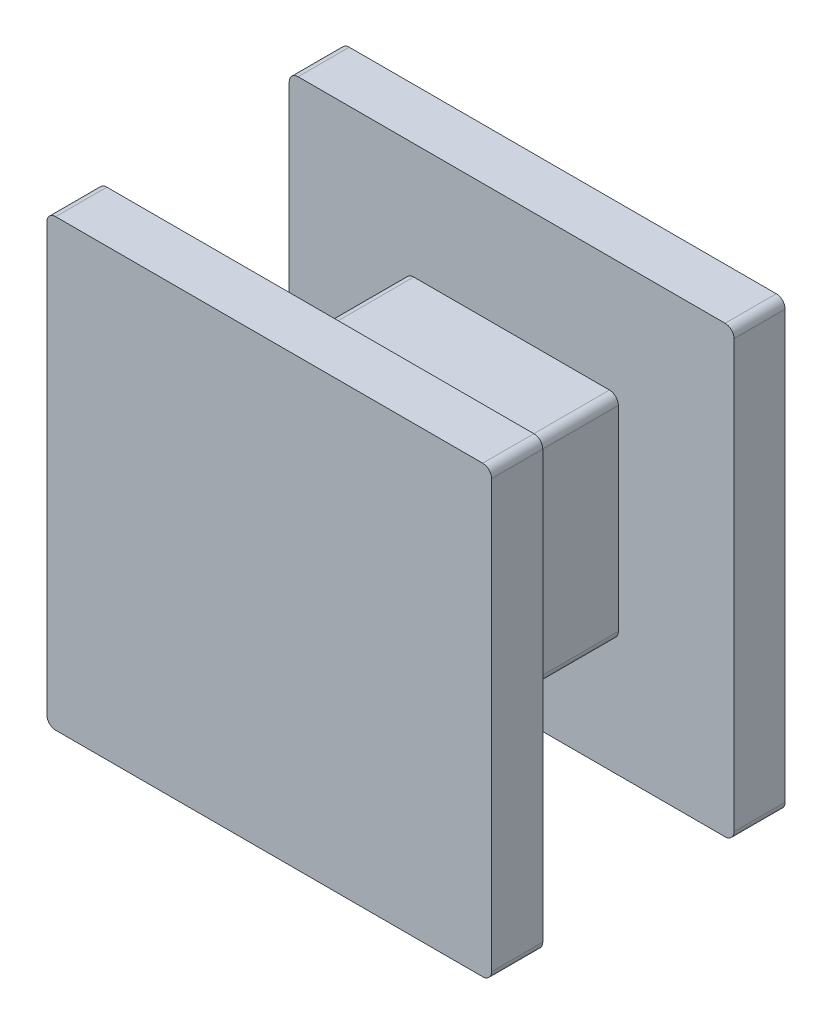
ISO-10303-21;
HEADER;
FILE_DESCRIPTION(('STEP AP214'),'2;1');
FILE_NAME('part.step','',(''),(''),'','','');
FILE_SCHEMA(('AUTOMOTIVE_DESIGN { 1 0 10303 214 1 1 1 1 }'));
ENDSEC;
DATA;
#1=APPLICATION_CONTEXT('core data for automotive mechanical design processes');
#2=APPLICATION_PROTOCOL_DEFINITION('international standard','automotive_design',2000,#1);
#3=PRODUCT_CONTEXT('',#1,'mechanical');
#4=PRODUCT('Part','Part','',(#3));
#5=PRODUCT_RELATED_PRODUCT_CATEGORY('part','',(#4));
#6=PRODUCT_DEFINITION_FORMATION('','',#4);
#7=PRODUCT_DEFINITION_CONTEXT('part definition',#1,'design');
#8=PRODUCT_DEFINITION('design','',#6,#7);
#9=PRODUCT_DEFINITION_SHAPE('','',#8);
#10=(LENGTH_UNIT() NAMED_UNIT(*) SI_UNIT(.MILLI.,.METRE.));
#11=(NAMED_UNIT(*) PLANE_ANGLE_UNIT() SI_UNIT($,.RADIAN.));
#12=(NAMED_UNIT(*) SI_UNIT($,.STERADIAN.) SOLID_ANGLE_UNIT());
#13=UNCERTAINTY_MEASURE_WITH_UNIT(LENGTH_MEASURE(1.E-05),#10,'distance_accuracy_value','');
#14=(GEOMETRIC_REPRESENTATION_CONTEXT(3) GLOBAL_UNCERTAINTY_ASSIGNED_CONTEXT((#13)) GLOBAL_UNIT_ASSIGNED_CONTEXT((#10,
#11,#12)) REPRESENTATION_CONTEXT('',''));
#15=CARTESIAN_POINT('',(0.,0.,0.));
#16=DIRECTION('',(0.,0.,1.));
#17=DIRECTION('',(1.,0.,0.));
#18=AXIS2_PLACEMENT_3D('',#15,#16,#17);
#19=CARTESIAN_POINT('',(0.,0.,4.3));
#20=DIRECTION('',(1.,0.,0.));
#21=DIRECTION('',(0.,1.,0.));
#22=AXIS2_PLACEMENT_3D('',#19,#20,#21);
#23=PLANE('',#22);
#24=DIRECTION('',(0.,-1.,0.));
#25=VECTOR('',#24,1.);
#26=CARTESIAN_POINT('',(0.,0.,0.));
#27=LINE('',#26,#25);
#28=CARTESIAN_POINT('',(0.,-0.2,0.));
#29=VERTEX_POINT('',#28);
#30=CARTESIAN_POINT('',(0.,-4.6,0.));
#31=VERTEX_POINT('',#30);
#32=EDGE_CURVE('E265',#29,#31,#27,.T.);
#33=ORIENTED_EDGE('',*,*,#32,.T.);
#34=DIRECTION('',(0.,0.,-1.));
#35=VECTOR('',#34,1.);
#36=CARTESIAN_POINT('',(0.,-4.6,4.3));
#37=LINE('',#36,#35);
#38=CARTESIAN_POINT('',(0.,-4.6,4.3));
#39=VERTEX_POINT('',#38);
#40=EDGE_CURVE('E375',#31,#39,#37,.F.);
#41=ORIENTED_EDGE('',*,*,#40,.T.);
#42=DIRECTION('',(0.,-1.,0.));
#43=VECTOR('',#42,1.);
#44=CARTESIAN_POINT('',(0.,0.,4.3));
#45=LINE('',#44,#43);
#46=CARTESIAN_POINT('',(0.,-0.2,4.3));
#47=VERTEX_POINT('',#46);
#48=EDGE_CURVE('E248',#47,#39,#45,.T.);
#49=ORIENTED_EDGE('',*,*,#48,.F.);
#50=DIRECTION('',(0.,0.,-1.));
#51=VECTOR('',#50,1.);
#52=CARTESIAN_POINT('',(0.,-0.2,4.3));
#53=LINE('',#52,#51);
#54=EDGE_CURVE('E371',#47,#29,#53,.T.);
#55=ORIENTED_EDGE('',*,*,#54,.T.);
#56=EDGE_LOOP('',(#33,#41,#49,#55));
#57=FACE_BOUND('',#56,.T.);
#58=ADVANCED_FACE('F42',(#57),#23,.F.);
#59=CARTESIAN_POINT('',(0.,-4.8,4.3));
#60=DIRECTION('',(0.,1.,0.));
#61=DIRECTION('',(0.,0.,1.));
#62=AXIS2_PLACEMENT_3D('',#59,#60,#61);
#63=PLANE('',#62);
#64=DIRECTION('',(1.,0.,0.));
#65=VECTOR('',#64,1.);
#66=CARTESIAN_POINT('',(0.,-4.8,0.));
#67=LINE('',#66,#65);
#68=CARTESIAN_POINT('',(0.200000000000001,-4.8,0.));
#69=VERTEX_POINT('',#68);
#70=CARTESIAN_POINT('',(4.6,-4.8,0.));
#71=VERTEX_POINT('',#70);
#72=EDGE_CURVE('E269',#69,#71,#67,.T.);
#73=ORIENTED_EDGE('',*,*,#72,.T.);
#74=DIRECTION('',(0.,0.,-1.));
#75=VECTOR('',#74,1.);
#76=CARTESIAN_POINT('',(4.6,-4.8,4.3));
#77=LINE('',#76,#75);
#78=CARTESIAN_POINT('',(4.6,-4.8,4.3));
#79=VERTEX_POINT('',#78);
#80=EDGE_CURVE('E368',#71,#79,#77,.F.);
#81=ORIENTED_EDGE('',*,*,#80,.T.);
#82=DIRECTION('',(1.,0.,0.));
#83=VECTOR('',#82,1.);
#84=CARTESIAN_POINT('',(0.,-4.8,4.3));
#85=LINE('',#84,#83);
#86=CARTESIAN_POINT('',(0.200000000000001,-4.8,4.3));
#87=VERTEX_POINT('',#86);
#88=EDGE_CURVE('E252',#87,#79,#85,.T.);
#89=ORIENTED_EDGE('',*,*,#88,.F.);
#90=DIRECTION('',(0.,0.,-1.));
#91=VECTOR('',#90,1.);
#92=CARTESIAN_POINT('',(0.200000000000001,-4.8,4.3));
#93=LINE('',#92,#91);
#94=EDGE_CURVE('E364',#87,#69,#93,.T.);
#95=ORIENTED_EDGE('',*,*,#94,.T.);
#96=EDGE_LOOP('',(#73,#81,#89,#95));
#97=FACE_BOUND('',#96,.T.);
#98=ADVANCED_FACE('F449',(#97),#63,.F.);
#99=CARTESIAN_POINT('',(4.8,0.,4.3));
#100=DIRECTION('',(-1.,0.,0.));
#101=DIRECTION('',(0.,-1.,0.));
#102=AXIS2_PLACEMENT_3D('',#99,#100,#101);
#103=PLANE('',#102);
#104=DIRECTION('',(0.,1.,0.));
#105=VECTOR('',#104,1.);
#106=CARTESIAN_POINT('',(4.8,0.,4.3));
#107=LINE('',#106,#105);
#108=CARTESIAN_POINT('',(4.8,-4.6,4.3));
#109=VERTEX_POINT('',#108);
#110=CARTESIAN_POINT('',(4.8,-0.2,4.3));
#111=VERTEX_POINT('',#110);
#112=EDGE_CURVE('E257',#109,#111,#107,.T.);
#113=ORIENTED_EDGE('',*,*,#112,.F.);
#114=DIRECTION('',(0.,0.,-1.));
#115=VECTOR('',#114,1.);
#116=CARTESIAN_POINT('',(4.8,-4.6,4.3));
#117=LINE('',#116,#115);
#118=CARTESIAN_POINT('',(4.8,-4.6,0.));
#119=VERTEX_POINT('',#118);
#120=EDGE_CURVE('E360',#109,#119,#117,.T.);
#121=ORIENTED_EDGE('',*,*,#120,.T.);
#122=DIRECTION('',(0.,1.,0.));
#123=VECTOR('',#122,1.);
#124=CARTESIAN_POINT('',(4.8,0.,0.));
#125=LINE('',#124,#123);
#126=CARTESIAN_POINT('',(4.8,-0.2,0.));
#127=VERTEX_POINT('',#126);
#128=EDGE_CURVE('E274',#119,#127,#125,.T.);
#129=ORIENTED_EDGE('',*,*,#128,.T.);
#130=DIRECTION('',(0.,0.,-1.));
#131=VECTOR('',#130,1.);
#132=CARTESIAN_POINT('',(4.8,-0.2,4.3));
#133=LINE('',#132,#131);
#134=EDGE_CURVE('E357',#127,#111,#133,.F.);
#135=ORIENTED_EDGE('',*,*,#134,.T.);
#136=EDGE_LOOP('',(#113,#121,#129,#135));
#137=FACE_BOUND('',#136,.T.);
#138=ADVANCED_FACE('F427',(#137),#103,.F.);
#139=CARTESIAN_POINT('',(0.,0.,4.3));
#140=DIRECTION('',(0.,-1.,0.));
#141=DIRECTION('',(0.,0.,-1.));
#142=AXIS2_PLACEMENT_3D('',#139,#140,#141);
#143=PLANE('',#142);
#144=DIRECTION('',(-1.,0.,0.));
#145=VECTOR('',#144,1.);
#146=CARTESIAN_POINT('',(0.,0.,0.));
#147=LINE('',#146,#145);
#148=CARTESIAN_POINT('',(4.6,0.,0.));
#149=VERTEX_POINT('',#148);
#150=CARTESIAN_POINT('',(0.2,0.,0.));
#151=VERTEX_POINT('',#150);
#152=EDGE_CURVE('E253',#149,#151,#147,.T.);
#153=ORIENTED_EDGE('',*,*,#152,.T.);
#154=DIRECTION('',(0.,0.,-1.));
#155=VECTOR('',#154,1.);
#156=CARTESIAN_POINT('',(0.2,0.,4.3));
#157=LINE('',#156,#155);
#158=CARTESIAN_POINT('',(0.2,0.,4.3));
#159=VERTEX_POINT('',#158);
#160=EDGE_CURVE('E389',#151,#159,#157,.F.);
#161=ORIENTED_EDGE('',*,*,#160,.T.);
#162=DIRECTION('',(-1.,0.,0.));
#163=VECTOR('',#162,1.);
#164=CARTESIAN_POINT('',(0.,0.,4.3));
#165=LINE('',#164,#163);
#166=CARTESIAN_POINT('',(4.6,0.,4.3));
#167=VERTEX_POINT('',#166);
#168=EDGE_CURVE('E261',#167,#159,#165,.T.);
#169=ORIENTED_EDGE('',*,*,#168,.F.);
#170=DIRECTION('',(0.,0.,-1.));
#171=VECTOR('',#170,1.);
#172=CARTESIAN_POINT('',(4.6,0.,4.3));
#173=LINE('',#172,#171);
#174=EDGE_CURVE('E385',#167,#149,#173,.T.);
#175=ORIENTED_EDGE('',*,*,#174,.T.);
#176=EDGE_LOOP('',(#153,#161,#169,#175));
#177=FACE_BOUND('',#176,.T.);
#178=ADVANCED_FACE('F434',(#177),#143,.F.);
#179=CARTESIAN_POINT('',(0.,0.,4.3));
#180=DIRECTION('',(0.,0.,1.));
#181=DIRECTION('',(1.,0.,0.));
#182=AXIS2_PLACEMENT_3D('',#179,#180,#181);
#183=PLANE('',#182);
#184=DIRECTION('',(0.,1.,0.));
#185=VECTOR('',#184,1.);
#186=CARTESIAN_POINT('',(7.4,2.6,4.3));
#187=LINE('',#186,#185);
#188=CARTESIAN_POINT('',(7.4,-7.2,4.3));
#189=VERTEX_POINT('',#188);
#190=CARTESIAN_POINT('',(7.4,2.4,4.3));
#191=VERTEX_POINT('',#190);
#192=EDGE_CURVE('E223',#189,#191,#187,.T.);
#193=ORIENTED_EDGE('',*,*,#192,.F.);
#194=CARTESIAN_POINT('',(7.2,-7.2,4.3));
#195=DIRECTION('',(0.,0.,1.));
#196=DIRECTION('',(1.,0.,0.));
#197=AXIS2_PLACEMENT_3D('',#194,#195,#196);
#198=CIRCLE('',#197,0.2);
#199=CARTESIAN_POINT('',(7.2,-7.4,4.3));
#200=VERTEX_POINT('',#199);
#201=EDGE_CURVE('E205',#189,#200,#198,.F.);
#202=ORIENTED_EDGE('',*,*,#201,.T.);
#203=DIRECTION('',(1.,0.,0.));
#204=VECTOR('',#203,1.);
#205=CARTESIAN_POINT('',(-2.6,-7.4,4.3));
#206=LINE('',#205,#204);
#207=CARTESIAN_POINT('',(-2.4,-7.4,4.3));
#208=VERTEX_POINT('',#207);
#209=EDGE_CURVE('E237',#208,#200,#206,.T.);
#210=ORIENTED_EDGE('',*,*,#209,.F.);
#211=CARTESIAN_POINT('',(-2.4,-7.2,4.3));
#212=DIRECTION('',(0.,0.,1.));
#213=DIRECTION('',(1.,0.,0.));
#214=AXIS2_PLACEMENT_3D('',#211,#212,#213);
#215=CIRCLE('',#214,0.2);
#216=CARTESIAN_POINT('',(-2.6,-7.2,4.3));
#217=VERTEX_POINT('',#216);
#218=EDGE_CURVE('E217',#208,#217,#215,.F.);
#219=ORIENTED_EDGE('',*,*,#218,.T.);
#220=DIRECTION('',(0.,-1.,0.));
#221=VECTOR('',#220,1.);
#222=CARTESIAN_POINT('',(-2.6,2.6,4.3));
#223=LINE('',#222,#221);
#224=CARTESIAN_POINT('',(-2.6,2.4,4.3));
#225=VERTEX_POINT('',#224);
#226=EDGE_CURVE('E244',#225,#217,#223,.T.);
#227=ORIENTED_EDGE('',*,*,#226,.F.);
#228=CARTESIAN_POINT('',(-2.4,2.4,4.3));
#229=DIRECTION('',(0.,0.,1.));
#230=DIRECTION('',(1.,0.,0.));
#231=AXIS2_PLACEMENT_3D('',#228,#229,#230);
#232=CIRCLE('',#231,0.2);
#233=CARTESIAN_POINT('',(-2.4,2.6,4.3));
#234=VERTEX_POINT('',#233);
#235=EDGE_CURVE('E228',#225,#234,#232,.F.);
#236=ORIENTED_EDGE('',*,*,#235,.T.);
#237=DIRECTION('',(-1.,0.,0.));
#238=VECTOR('',#237,1.);
#239=CARTESIAN_POINT('',(-2.6,2.6,4.3));
#240=LINE('',#239,#238);
#241=CARTESIAN_POINT('',(7.2,2.6,4.3));
#242=VERTEX_POINT('',#241);
#243=EDGE_CURVE('E236',#242,#234,#240,.T.);
#244=ORIENTED_EDGE('',*,*,#243,.F.);
#245=CARTESIAN_POINT('',(7.2,2.4,4.3));
#246=DIRECTION('',(0.,0.,1.));
#247=DIRECTION('',(1.,0.,0.));
#248=AXIS2_PLACEMENT_3D('',#245,#246,#247);
#249=CIRCLE('',#248,0.2);
#250=EDGE_CURVE('E234',#242,#191,#249,.F.);
#251=ORIENTED_EDGE('',*,*,#250,.T.);
#252=EDGE_LOOP('',(#193,#202,#210,#219,#227,#236,#244,#251));
#253=FACE_BOUND('',#252,.T.);
#254=ORIENTED_EDGE('',*,*,#112,.T.);
#255=CARTESIAN_POINT('',(4.6,-0.2,4.3));
#256=DIRECTION('',(0.,0.,1.));
#257=DIRECTION('',(1.,0.,0.));
#258=AXIS2_PLACEMENT_3D('',#255,#256,#257);
#259=CIRCLE('',#258,0.2);
#260=EDGE_CURVE('E11',#111,#167,#259,.T.);
#261=ORIENTED_EDGE('',*,*,#260,.T.);
#262=ORIENTED_EDGE('',*,*,#168,.T.);
#263=CARTESIAN_POINT('',(0.2,-0.2,4.3));
#264=DIRECTION('',(0.,0.,1.));
#265=DIRECTION('',(1.,0.,0.));
#266=AXIS2_PLACEMENT_3D('',#263,#264,#265);
#267=CIRCLE('',#266,0.2);
#268=EDGE_CURVE('E413',#159,#47,#267,.T.);
#269=ORIENTED_EDGE('',*,*,#268,.T.);
#270=ORIENTED_EDGE('',*,*,#48,.T.);
#271=CARTESIAN_POINT('',(0.200000000000001,-4.6,4.3));
#272=DIRECTION('',(0.,0.,1.));
#273=DIRECTION('',(1.,0.,0.));
#274=AXIS2_PLACEMENT_3D('',#271,#272,#273);
#275=CIRCLE('',#274,0.2);
#276=EDGE_CURVE('E407',#39,#87,#275,.T.);
#277=ORIENTED_EDGE('',*,*,#276,.T.);
#278=ORIENTED_EDGE('',*,*,#88,.T.);
#279=CARTESIAN_POINT('',(4.6,-4.6,4.3));
#280=DIRECTION('',(0.,0.,1.));
#281=DIRECTION('',(1.,0.,0.));
#282=AXIS2_PLACEMENT_3D('',#279,#280,#281);
#283=CIRCLE('',#282,0.2);
#284=EDGE_CURVE('E401',#79,#109,#283,.T.);
#285=ORIENTED_EDGE('',*,*,#284,.T.);
#286=EDGE_LOOP('',(#254,#261,#262,#269,#270,#277,#278,#285));
#287=FACE_BOUND('',#286,.T.);
#288=ADVANCED_FACE('F231',(#253,#287),#183,.F.);
#289=CARTESIAN_POINT('',(-2.6,2.6,5.45));
#290=DIRECTION('',(1.,0.,0.));
#291=DIRECTION('',(0.,1.,0.));
#292=AXIS2_PLACEMENT_3D('',#289,#290,#291);
#293=PLANE('',#292);
#294=ORIENTED_EDGE('',*,*,#226,.T.);
#295=DIRECTION('',(0.,0.,-1.));
#296=VECTOR('',#295,1.);
#297=CARTESIAN_POINT('',(-2.6,-7.2,5.45));
#298=LINE('',#297,#296);
#299=CARTESIAN_POINT('',(-2.6,-7.2,5.45));
#300=VERTEX_POINT('',#299);
#301=EDGE_CURVE('E310',#217,#300,#298,.F.);
#302=ORIENTED_EDGE('',*,*,#301,.T.);
#303=DIRECTION('',(0.,-1.,0.));
#304=VECTOR('',#303,1.);
#305=CARTESIAN_POINT('',(-2.6,2.6,5.45));
#306=LINE('',#305,#304);
#307=CARTESIAN_POINT('',(-2.6,2.4,5.45));
#308=VERTEX_POINT('',#307);
#309=EDGE_CURVE('E242',#308,#300,#306,.T.);
#310=ORIENTED_EDGE('',*,*,#309,.F.);
#311=DIRECTION('',(0.,0.,-1.));
#312=VECTOR('',#311,1.);
#313=CARTESIAN_POINT('',(-2.6,2.4,5.45));
#314=LINE('',#313,#312);
#315=EDGE_CURVE('E306',#308,#225,#314,.T.);
#316=ORIENTED_EDGE('',*,*,#315,.T.);
#317=EDGE_LOOP('',(#294,#302,#310,#316));
#318=FACE_BOUND('',#317,.T.);
#319=ADVANCED_FACE('F538',(#318),#293,.F.);
#320=CARTESIAN_POINT('',(-2.6,-7.4,5.45));
#321=DIRECTION('',(0.,1.,0.));
#322=DIRECTION('',(-1.,0.,0.));
#323=AXIS2_PLACEMENT_3D('',#320,#321,#322);
#324=PLANE('',#323);
#325=ORIENTED_EDGE('',*,*,#209,.T.);
#326=DIRECTION('',(0.,0.,-1.));
#327=VECTOR('',#326,1.);
#328=CARTESIAN_POINT('',(7.2,-7.4,5.45));
#329=LINE('',#328,#327);
#330=CARTESIAN_POINT('',(7.2,-7.4,5.45));
#331=VERTEX_POINT('',#330);
#332=EDGE_CURVE('E210',#200,#331,#329,.F.);
#333=ORIENTED_EDGE('',*,*,#332,.T.);
#334=DIRECTION('',(1.,0.,0.));
#335=VECTOR('',#334,1.);
#336=CARTESIAN_POINT('',(-2.6,-7.4,5.45));
#337=LINE('',#336,#335);
#338=CARTESIAN_POINT('',(-2.4,-7.4,5.45));
#339=VERTEX_POINT('',#338);
#340=EDGE_CURVE('E525',#339,#331,#337,.T.);
#341=ORIENTED_EDGE('',*,*,#340,.F.);
#342=DIRECTION('',(0.,0.,-1.));
#343=VECTOR('',#342,1.);
#344=CARTESIAN_POINT('',(-2.4,-7.4,5.45));
#345=LINE('',#344,#343);
#346=EDGE_CURVE('E216',#339,#208,#345,.T.);
#347=ORIENTED_EDGE('',*,*,#346,.T.);
#348=EDGE_LOOP('',(#325,#333,#341,#347));
#349=FACE_BOUND('',#348,.T.);
#350=ADVANCED_FACE('F547',(#349),#324,.F.);
#351=CARTESIAN_POINT('',(7.4,2.6,5.45));
#352=DIRECTION('',(-1.,0.,0.));
#353=DIRECTION('',(0.,-1.,0.));
#354=AXIS2_PLACEMENT_3D('',#351,#352,#353);
#355=PLANE('',#354);
#356=DIRECTION('',(0.,1.,0.));
#357=VECTOR('',#356,1.);
#358=CARTESIAN_POINT('',(7.4,2.6,5.45));
#359=LINE('',#358,#357);
#360=CARTESIAN_POINT('',(7.4,-7.2,5.45));
#361=VERTEX_POINT('',#360);
#362=CARTESIAN_POINT('',(7.4,2.4,5.45));
#363=VERTEX_POINT('',#362);
#364=EDGE_CURVE('E226',#361,#363,#359,.T.);
#365=ORIENTED_EDGE('',*,*,#364,.F.);
#366=DIRECTION('',(0.,0.,-1.));
#367=VECTOR('',#366,1.);
#368=CARTESIAN_POINT('',(7.4,-7.2,5.45));
#369=LINE('',#368,#367);
#370=EDGE_CURVE('E209',#361,#189,#369,.T.);
#371=ORIENTED_EDGE('',*,*,#370,.T.);
#372=ORIENTED_EDGE('',*,*,#192,.T.);
#373=DIRECTION('',(0.,0.,-1.));
#374=VECTOR('',#373,1.);
#375=CARTESIAN_POINT('',(7.4,2.4,5.45));
#376=LINE('',#375,#374);
#377=EDGE_CURVE('E229',#191,#363,#376,.F.);
#378=ORIENTED_EDGE('',*,*,#377,.T.);
#379=EDGE_LOOP('',(#365,#371,#372,#378));
#380=FACE_BOUND('',#379,.T.);
#381=ADVANCED_FACE('F222',(#380),#355,.F.);
#382=CARTESIAN_POINT('',(-2.6,2.6,5.45));
#383=DIRECTION('',(0.,-1.,0.));
#384=DIRECTION('',(1.,0.,0.));
#385=AXIS2_PLACEMENT_3D('',#382,#383,#384);
#386=PLANE('',#385);
#387=DIRECTION('',(-1.,0.,0.));
#388=VECTOR('',#387,1.);
#389=CARTESIAN_POINT('',(-2.6,2.6,5.45));
#390=LINE('',#389,#388);
#391=CARTESIAN_POINT('',(7.2,2.6,5.45));
#392=VERTEX_POINT('',#391);
#393=CARTESIAN_POINT('',(-2.4,2.6,5.45));
#394=VERTEX_POINT('',#393);
#395=EDGE_CURVE('E270',#392,#394,#390,.T.);
#396=ORIENTED_EDGE('',*,*,#395,.F.);
#397=DIRECTION('',(0.,0.,-1.));
#398=VECTOR('',#397,1.);
#399=CARTESIAN_POINT('',(7.2,2.6,5.45));
#400=LINE('',#399,#398);
#401=EDGE_CURVE('E381',#392,#242,#400,.T.);
#402=ORIENTED_EDGE('',*,*,#401,.T.);
#403=ORIENTED_EDGE('',*,*,#243,.T.);
#404=DIRECTION('',(0.,0.,-1.));
#405=VECTOR('',#404,1.);
#406=CARTESIAN_POINT('',(-2.4,2.6,5.45));
#407=LINE('',#406,#405);
#408=EDGE_CURVE('E378',#234,#394,#407,.F.);
#409=ORIENTED_EDGE('',*,*,#408,.T.);
#410=EDGE_LOOP('',(#396,#402,#403,#409));
#411=FACE_BOUND('',#410,.T.);
#412=ADVANCED_FACE('F554',(#411),#386,.F.);
#413=CARTESIAN_POINT('',(0.,0.,5.45));
#414=DIRECTION('',(0.,0.,1.));
#415=DIRECTION('',(1.,0.,0.));
#416=AXIS2_PLACEMENT_3D('',#413,#414,#415);
#417=PLANE('',#416);
#418=ORIENTED_EDGE('',*,*,#340,.T.);
#419=CARTESIAN_POINT('',(7.2,-7.2,5.45));
#420=DIRECTION('',(0.,0.,1.));
#421=DIRECTION('',(1.,0.,0.));
#422=AXIS2_PLACEMENT_3D('',#419,#420,#421);
#423=CIRCLE('',#422,0.2);
#424=EDGE_CURVE('E303',#331,#361,#423,.T.);
#425=ORIENTED_EDGE('',*,*,#424,.T.);
#426=ORIENTED_EDGE('',*,*,#364,.T.);
#427=CARTESIAN_POINT('',(7.2,2.4,5.45));
#428=DIRECTION('',(0.,0.,1.));
#429=DIRECTION('',(1.,0.,0.));
#430=AXIS2_PLACEMENT_3D('',#427,#428,#429);
#431=CIRCLE('',#430,0.2);
#432=EDGE_CURVE('E297',#363,#392,#431,.T.);
#433=ORIENTED_EDGE('',*,*,#432,.T.);
#434=ORIENTED_EDGE('',*,*,#395,.T.);
#435=CARTESIAN_POINT('',(-2.4,2.4,5.45));
#436=DIRECTION('',(0.,0.,1.));
#437=DIRECTION('',(1.,0.,0.));
#438=AXIS2_PLACEMENT_3D('',#435,#436,#437);
#439=CIRCLE('',#438,0.2);
#440=EDGE_CURVE('E294',#394,#308,#439,.T.);
#441=ORIENTED_EDGE('',*,*,#440,.T.);
#442=ORIENTED_EDGE('',*,*,#309,.T.);
#443=CARTESIAN_POINT('',(-2.4,-7.2,5.45));
#444=DIRECTION('',(0.,0.,1.));
#445=DIRECTION('',(1.,0.,0.));
#446=AXIS2_PLACEMENT_3D('',#443,#444,#445);
#447=CIRCLE('',#446,0.2);
#448=EDGE_CURVE('E300',#300,#339,#447,.T.);
#449=ORIENTED_EDGE('',*,*,#448,.T.);
#450=EDGE_LOOP('',(#418,#425,#426,#433,#434,#441,#442,#449));
#451=FACE_BOUND('',#450,.T.);
#452=ADVANCED_FACE('F545',(#451),#417,.T.);
#453=CARTESIAN_POINT('',(7.4,2.6,-1.15));
#454=DIRECTION('',(-1.,0.,0.));
#455=DIRECTION('',(0.,0.,1.));
#456=AXIS2_PLACEMENT_3D('',#453,#454,#455);
#457=PLANE('',#456);
#458=DIRECTION('',(0.,-1.,0.));
#459=VECTOR('',#458,1.);
#460=CARTESIAN_POINT('',(7.4,2.6,0.));
#461=LINE('',#460,#459);
#462=CARTESIAN_POINT('',(7.4,2.4,0.));
#463=VERTEX_POINT('',#462);
#464=CARTESIAN_POINT('',(7.4,-7.2,0.));
#465=VERTEX_POINT('',#464);
#466=EDGE_CURVE('E508',#463,#465,#461,.T.);
#467=ORIENTED_EDGE('',*,*,#466,.T.);
#468=DIRECTION('',(0.,0.,1.));
#469=VECTOR('',#468,1.);
#470=CARTESIAN_POINT('',(7.4,-7.2,-1.15));
#471=LINE('',#470,#469);
#472=CARTESIAN_POINT('',(7.4,-7.2,-1.15));
#473=VERTEX_POINT('',#472);
#474=EDGE_CURVE('E354',#465,#473,#471,.F.);
#475=ORIENTED_EDGE('',*,*,#474,.T.);
#476=DIRECTION('',(0.,-1.,0.));
#477=VECTOR('',#476,1.);
#478=CARTESIAN_POINT('',(7.4,2.6,-1.15));
#479=LINE('',#478,#477);
#480=CARTESIAN_POINT('',(7.4,2.4,-1.15));
#481=VERTEX_POINT('',#480);
#482=EDGE_CURVE('E504',#481,#473,#479,.T.);
#483=ORIENTED_EDGE('',*,*,#482,.F.);
#484=DIRECTION('',(0.,0.,1.));
#485=VECTOR('',#484,1.);
#486=CARTESIAN_POINT('',(7.4,2.4,-1.15));
#487=LINE('',#486,#485);
#488=EDGE_CURVE('E350',#481,#463,#487,.T.);
#489=ORIENTED_EDGE('',*,*,#488,.T.);
#490=EDGE_LOOP('',(#467,#475,#483,#489));
#491=FACE_BOUND('',#490,.T.);
#492=ADVANCED_FACE('F610',(#491),#457,.F.);
#493=CARTESIAN_POINT('',(7.4,-7.4,-1.15));
#494=DIRECTION('',(0.,1.,0.));
#495=DIRECTION('',(0.,0.,1.));
#496=AXIS2_PLACEMENT_3D('',#493,#494,#495);
#497=PLANE('',#496);
#498=DIRECTION('',(-1.,0.,0.));
#499=VECTOR('',#498,1.);
#500=CARTESIAN_POINT('',(7.4,-7.4,0.));
#501=LINE('',#500,#499);
#502=CARTESIAN_POINT('',(7.2,-7.4,0.));
#503=VERTEX_POINT('',#502);
#504=CARTESIAN_POINT('',(-2.4,-7.4,0.));
#505=VERTEX_POINT('',#504);
#506=EDGE_CURVE('E512',#503,#505,#501,.T.);
#507=ORIENTED_EDGE('',*,*,#506,.T.);
#508=DIRECTION('',(0.,0.,1.));
#509=VECTOR('',#508,1.);
#510=CARTESIAN_POINT('',(-2.4,-7.4,-1.15));
#511=LINE('',#510,#509);
#512=CARTESIAN_POINT('',(-2.4,-7.4,-1.15));
#513=VERTEX_POINT('',#512);
#514=EDGE_CURVE('E336',#505,#513,#511,.F.);
#515=ORIENTED_EDGE('',*,*,#514,.T.);
#516=DIRECTION('',(-1.,0.,0.));
#517=VECTOR('',#516,1.);
#518=CARTESIAN_POINT('',(7.4,-7.4,-1.15));
#519=LINE('',#518,#517);
#520=CARTESIAN_POINT('',(7.2,-7.4,-1.15));
#521=VERTEX_POINT('',#520);
#522=EDGE_CURVE('E492',#521,#513,#519,.T.);
#523=ORIENTED_EDGE('',*,*,#522,.F.);
#524=DIRECTION('',(0.,0.,1.));
#525=VECTOR('',#524,1.);
#526=CARTESIAN_POINT('',(7.2,-7.4,-1.15));
#527=LINE('',#526,#525);
#528=EDGE_CURVE('E332',#521,#503,#527,.T.);
#529=ORIENTED_EDGE('',*,*,#528,.T.);
#530=EDGE_LOOP('',(#507,#515,#523,#529));
#531=FACE_BOUND('',#530,.T.);
#532=ADVANCED_FACE('F620',(#531),#497,.F.);
#533=CARTESIAN_POINT('',(-2.6,2.6,-1.15));
#534=DIRECTION('',(1.,0.,0.));
#535=DIRECTION('',(0.,1.,0.));
#536=AXIS2_PLACEMENT_3D('',#533,#534,#535);
#537=PLANE('',#536);
#538=DIRECTION('',(0.,1.,0.));
#539=VECTOR('',#538,1.);
#540=CARTESIAN_POINT('',(-2.6,2.6,-1.15));
#541=LINE('',#540,#539);
#542=CARTESIAN_POINT('',(-2.6,-7.2,-1.15));
#543=VERTEX_POINT('',#542);
#544=CARTESIAN_POINT('',(-2.6,2.4,-1.15));
#545=VERTEX_POINT('',#544);
#546=EDGE_CURVE('E490',#543,#545,#541,.T.);
#547=ORIENTED_EDGE('',*,*,#546,.F.);
#548=DIRECTION('',(0.,0.,1.));
#549=VECTOR('',#548,1.);
#550=CARTESIAN_POINT('',(-2.6,-7.2,-1.15));
#551=LINE('',#550,#549);
#552=CARTESIAN_POINT('',(-2.6,-7.2,0.));
#553=VERTEX_POINT('',#552);
#554=EDGE_CURVE('E316',#543,#553,#551,.T.);
#555=ORIENTED_EDGE('',*,*,#554,.T.);
#556=DIRECTION('',(0.,1.,0.));
#557=VECTOR('',#556,1.);
#558=CARTESIAN_POINT('',(-2.6,2.6,0.));
#559=LINE('',#558,#557);
#560=CARTESIAN_POINT('',(-2.6,2.4,0.));
#561=VERTEX_POINT('',#560);
#562=EDGE_CURVE('E516',#553,#561,#559,.T.);
#563=ORIENTED_EDGE('',*,*,#562,.T.);
#564=DIRECTION('',(0.,0.,1.));
#565=VECTOR('',#564,1.);
#566=CARTESIAN_POINT('',(-2.6,2.4,-1.15));
#567=LINE('',#566,#565);
#568=EDGE_CURVE('E313',#561,#545,#567,.F.);
#569=ORIENTED_EDGE('',*,*,#568,.T.);
#570=EDGE_LOOP('',(#547,#555,#563,#569));
#571=FACE_BOUND('',#570,.T.);
#572=ADVANCED_FACE('F494',(#571),#537,.F.);
#573=CARTESIAN_POINT('',(7.4,2.6,-1.15));
#574=DIRECTION('',(0.,-1.,0.));
#575=DIRECTION('',(0.,0.,-1.));
#576=AXIS2_PLACEMENT_3D('',#573,#574,#575);
#577=PLANE('',#576);
#578=DIRECTION('',(1.,0.,0.));
#579=VECTOR('',#578,1.);
#580=CARTESIAN_POINT('',(7.4,2.6,0.));
#581=LINE('',#580,#579);
#582=CARTESIAN_POINT('',(-2.4,2.6,0.));
#583=VERTEX_POINT('',#582);
#584=CARTESIAN_POINT('',(7.2,2.6,0.));
#585=VERTEX_POINT('',#584);
#586=EDGE_CURVE('E519',#583,#585,#581,.T.);
#587=ORIENTED_EDGE('',*,*,#586,.T.);
#588=DIRECTION('',(0.,0.,1.));
#589=VECTOR('',#588,1.);
#590=CARTESIAN_POINT('',(7.2,2.6,-1.15));
#591=LINE('',#590,#589);
#592=CARTESIAN_POINT('',(7.2,2.6,-1.15));
#593=VERTEX_POINT('',#592);
#594=EDGE_CURVE('E58',#585,#593,#591,.F.);
#595=ORIENTED_EDGE('',*,*,#594,.T.);
#596=DIRECTION('',(1.,0.,0.));
#597=VECTOR('',#596,1.);
#598=CARTESIAN_POINT('',(7.4,2.6,-1.15));
#599=LINE('',#598,#597);
#600=CARTESIAN_POINT('',(-2.4,2.6,-1.15));
#601=VERTEX_POINT('',#600);
#602=EDGE_CURVE('E499',#601,#593,#599,.T.);
#603=ORIENTED_EDGE('',*,*,#602,.F.);
#604=DIRECTION('',(0.,0.,1.));
#605=VECTOR('',#604,1.);
#606=CARTESIAN_POINT('',(-2.4,2.6,-1.15));
#607=LINE('',#606,#605);
#608=EDGE_CURVE('E392',#601,#583,#607,.T.);
#609=ORIENTED_EDGE('',*,*,#608,.T.);
#610=EDGE_LOOP('',(#587,#595,#603,#609));
#611=FACE_BOUND('',#610,.T.);
#612=ADVANCED_FACE('F641',(#611),#577,.F.);
#613=CARTESIAN_POINT('',(0.,0.,-1.15));
#614=DIRECTION('',(0.,0.,-1.));
#615=DIRECTION('',(-1.,0.,0.));
#616=AXIS2_PLACEMENT_3D('',#613,#614,#615);
#617=PLANE('',#616);
#618=ORIENTED_EDGE('',*,*,#522,.T.);
#619=CARTESIAN_POINT('',(-2.4,-7.2,-1.15));
#620=DIRECTION('',(0.,0.,-1.));
#621=DIRECTION('',(-1.,0.,0.));
#622=AXIS2_PLACEMENT_3D('',#619,#620,#621);
#623=CIRCLE('',#622,0.2);
#624=EDGE_CURVE('E347',#513,#543,#623,.T.);
#625=ORIENTED_EDGE('',*,*,#624,.T.);
#626=ORIENTED_EDGE('',*,*,#546,.T.);
#627=CARTESIAN_POINT('',(-2.4,2.4,-1.15));
#628=DIRECTION('',(0.,0.,-1.));
#629=DIRECTION('',(-1.,0.,0.));
#630=AXIS2_PLACEMENT_3D('',#627,#628,#629);
#631=CIRCLE('',#630,0.2);
#632=EDGE_CURVE('E65',#545,#601,#631,.T.);
#633=ORIENTED_EDGE('',*,*,#632,.T.);
#634=ORIENTED_EDGE('',*,*,#602,.T.);
#635=CARTESIAN_POINT('',(7.2,2.4,-1.15));
#636=DIRECTION('',(0.,0.,-1.));
#637=DIRECTION('',(-1.,0.,0.));
#638=AXIS2_PLACEMENT_3D('',#635,#636,#637);
#639=CIRCLE('',#638,0.2);
#640=EDGE_CURVE('E341',#593,#481,#639,.T.);
#641=ORIENTED_EDGE('',*,*,#640,.T.);
#642=ORIENTED_EDGE('',*,*,#482,.T.);
#643=CARTESIAN_POINT('',(7.2,-7.2,-1.15));
#644=DIRECTION('',(0.,0.,-1.));
#645=DIRECTION('',(-1.,0.,0.));
#646=AXIS2_PLACEMENT_3D('',#643,#644,#645);
#647=CIRCLE('',#646,0.2);
#648=EDGE_CURVE('E344',#473,#521,#647,.T.);
#649=ORIENTED_EDGE('',*,*,#648,.T.);
#650=EDGE_LOOP('',(#618,#625,#626,#633,#634,#641,#642,#649));
#651=FACE_BOUND('',#650,.T.);
#652=ADVANCED_FACE('F489',(#651),#617,.T.);
#653=CARTESIAN_POINT('',(0.,0.,0.));
#654=DIRECTION('',(0.,0.,-1.));
#655=DIRECTION('',(-1.,0.,0.));
#656=AXIS2_PLACEMENT_3D('',#653,#654,#655);
#657=PLANE('',#656);
#658=ORIENTED_EDGE('',*,*,#32,.F.);
#659=CARTESIAN_POINT('',(0.2,-0.2,0.));
#660=DIRECTION('',(0.,0.,-1.));
#661=DIRECTION('',(-1.,0.,0.));
#662=AXIS2_PLACEMENT_3D('',#659,#660,#661);
#663=CIRCLE('',#662,0.2);
#664=EDGE_CURVE('E410',#29,#151,#663,.T.);
#665=ORIENTED_EDGE('',*,*,#664,.T.);
#666=ORIENTED_EDGE('',*,*,#152,.F.);
#667=CARTESIAN_POINT('',(4.6,-0.2,0.));
#668=DIRECTION('',(0.,0.,-1.));
#669=DIRECTION('',(-1.,0.,0.));
#670=AXIS2_PLACEMENT_3D('',#667,#668,#669);
#671=CIRCLE('',#670,0.2);
#672=EDGE_CURVE('E51',#149,#127,#671,.T.);
#673=ORIENTED_EDGE('',*,*,#672,.T.);
#674=ORIENTED_EDGE('',*,*,#128,.F.);
#675=CARTESIAN_POINT('',(4.6,-4.6,0.));
#676=DIRECTION('',(0.,0.,-1.));
#677=DIRECTION('',(-1.,0.,0.));
#678=AXIS2_PLACEMENT_3D('',#675,#676,#677);
#679=CIRCLE('',#678,0.2);
#680=EDGE_CURVE('E398',#119,#71,#679,.T.);
#681=ORIENTED_EDGE('',*,*,#680,.T.);
#682=ORIENTED_EDGE('',*,*,#72,.F.);
#683=CARTESIAN_POINT('',(0.200000000000001,-4.6,0.));
#684=DIRECTION('',(0.,0.,-1.));
#685=DIRECTION('',(-1.,0.,0.));
#686=AXIS2_PLACEMENT_3D('',#683,#684,#685);
#687=CIRCLE('',#686,0.2);
#688=EDGE_CURVE('E404',#69,#31,#687,.T.);
#689=ORIENTED_EDGE('',*,*,#688,.T.);
#690=EDGE_LOOP('',(#658,#665,#666,#673,#674,#681,#682,#689));
#691=FACE_BOUND('',#690,.T.);
#692=ORIENTED_EDGE('',*,*,#562,.F.);
#693=CARTESIAN_POINT('',(-2.4,-7.2,0.));
#694=DIRECTION('',(0.,0.,-1.));
#695=DIRECTION('',(-1.,0.,0.));
#696=AXIS2_PLACEMENT_3D('',#693,#694,#695);
#697=CIRCLE('',#696,0.2);
#698=EDGE_CURVE('E329',#553,#505,#697,.F.);
#699=ORIENTED_EDGE('',*,*,#698,.T.);
#700=ORIENTED_EDGE('',*,*,#506,.F.);
#701=CARTESIAN_POINT('',(7.2,-7.2,0.));
#702=DIRECTION('',(0.,0.,-1.));
#703=DIRECTION('',(-1.,0.,0.));
#704=AXIS2_PLACEMENT_3D('',#701,#702,#703);
#705=CIRCLE('',#704,0.2);
#706=EDGE_CURVE('E326',#503,#465,#705,.F.);
#707=ORIENTED_EDGE('',*,*,#706,.T.);
#708=ORIENTED_EDGE('',*,*,#466,.F.);
#709=CARTESIAN_POINT('',(7.2,2.4,0.));
#710=DIRECTION('',(0.,0.,-1.));
#711=DIRECTION('',(-1.,0.,0.));
#712=AXIS2_PLACEMENT_3D('',#709,#710,#711);
#713=CIRCLE('',#712,0.2);
#714=EDGE_CURVE('E323',#463,#585,#713,.F.);
#715=ORIENTED_EDGE('',*,*,#714,.T.);
#716=ORIENTED_EDGE('',*,*,#586,.F.);
#717=CARTESIAN_POINT('',(-2.4,2.4,0.));
#718=DIRECTION('',(0.,0.,-1.));
#719=DIRECTION('',(-1.,0.,0.));
#720=AXIS2_PLACEMENT_3D('',#717,#718,#719);
#721=CIRCLE('',#720,0.2);
#722=EDGE_CURVE('E320',#583,#561,#721,.F.);
#723=ORIENTED_EDGE('',*,*,#722,.T.);
#724=EDGE_LOOP('',(#692,#699,#700,#707,#708,#715,#716,#723));
#725=FACE_BOUND('',#724,.T.);
#726=ADVANCED_FACE('F420',(#691,#725),#657,.F.);
#727=CARTESIAN_POINT('',(7.2,-7.2,5.45));
#728=DIRECTION('',(0.,0.,-1.));
#729=DIRECTION('',(-1.,0.,0.));
#730=AXIS2_PLACEMENT_3D('',#727,#728,#729);
#731=CYLINDRICAL_SURFACE('',#730,0.2);
#732=ORIENTED_EDGE('',*,*,#424,.F.);
#733=ORIENTED_EDGE('',*,*,#332,.F.);
#734=ORIENTED_EDGE('',*,*,#201,.F.);
#735=ORIENTED_EDGE('',*,*,#370,.F.);
#736=EDGE_LOOP('',(#732,#733,#734,#735));
#737=FACE_BOUND('',#736,.T.);
#738=ADVANCED_FACE('F208',(#737),#731,.T.);
#739=CARTESIAN_POINT('',(-2.4,-7.2,5.45));
#740=DIRECTION('',(0.,0.,-1.));
#741=DIRECTION('',(-1.,0.,0.));
#742=AXIS2_PLACEMENT_3D('',#739,#740,#741);
#743=CYLINDRICAL_SURFACE('',#742,0.2);
#744=ORIENTED_EDGE('',*,*,#448,.F.);
#745=ORIENTED_EDGE('',*,*,#301,.F.);
#746=ORIENTED_EDGE('',*,*,#218,.F.);
#747=ORIENTED_EDGE('',*,*,#346,.F.);
#748=EDGE_LOOP('',(#744,#745,#746,#747));
#749=FACE_BOUND('',#748,.T.);
#750=ADVANCED_FACE('F476',(#749),#743,.T.);
#751=CARTESIAN_POINT('',(-2.4,-7.2,-1.15));
#752=DIRECTION('',(0.,0.,1.));
#753=DIRECTION('',(1.,0.,0.));
#754=AXIS2_PLACEMENT_3D('',#751,#752,#753);
#755=CYLINDRICAL_SURFACE('',#754,0.2);
#756=ORIENTED_EDGE('',*,*,#624,.F.);
#757=ORIENTED_EDGE('',*,*,#514,.F.);
#758=ORIENTED_EDGE('',*,*,#698,.F.);
#759=ORIENTED_EDGE('',*,*,#554,.F.);
#760=EDGE_LOOP('',(#756,#757,#758,#759));
#761=FACE_BOUND('',#760,.T.);
#762=ADVANCED_FACE('F463',(#761),#755,.T.);
#763=CARTESIAN_POINT('',(7.2,-7.2,-1.15));
#764=DIRECTION('',(0.,0.,1.));
#765=DIRECTION('',(1.,0.,0.));
#766=AXIS2_PLACEMENT_3D('',#763,#764,#765);
#767=CYLINDRICAL_SURFACE('',#766,0.2);
#768=ORIENTED_EDGE('',*,*,#648,.F.);
#769=ORIENTED_EDGE('',*,*,#474,.F.);
#770=ORIENTED_EDGE('',*,*,#706,.F.);
#771=ORIENTED_EDGE('',*,*,#528,.F.);
#772=EDGE_LOOP('',(#768,#769,#770,#771));
#773=FACE_BOUND('',#772,.T.);
#774=ADVANCED_FACE('F455',(#773),#767,.T.);
#775=CARTESIAN_POINT('',(4.6,-4.6,4.3));
#776=DIRECTION('',(0.,0.,-1.));
#777=DIRECTION('',(-1.,0.,0.));
#778=AXIS2_PLACEMENT_3D('',#775,#776,#777);
#779=CYLINDRICAL_SURFACE('',#778,0.2);
#780=ORIENTED_EDGE('',*,*,#284,.F.);
#781=ORIENTED_EDGE('',*,*,#80,.F.);
#782=ORIENTED_EDGE('',*,*,#680,.F.);
#783=ORIENTED_EDGE('',*,*,#120,.F.);
#784=EDGE_LOOP('',(#780,#781,#782,#783));
#785=FACE_BOUND('',#784,.T.);
#786=ADVANCED_FACE('F453',(#785),#779,.T.);
#787=CARTESIAN_POINT('',(0.200000000000001,-4.6,4.3));
#788=DIRECTION('',(0.,0.,-1.));
#789=DIRECTION('',(-1.,0.,0.));
#790=AXIS2_PLACEMENT_3D('',#787,#788,#789);
#791=CYLINDRICAL_SURFACE('',#790,0.2);
#792=ORIENTED_EDGE('',*,*,#276,.F.);
#793=ORIENTED_EDGE('',*,*,#40,.F.);
#794=ORIENTED_EDGE('',*,*,#688,.F.);
#795=ORIENTED_EDGE('',*,*,#94,.F.);
#796=EDGE_LOOP('',(#792,#793,#794,#795));
#797=FACE_BOUND('',#796,.T.);
#798=ADVANCED_FACE('F444',(#797),#791,.T.);
#799=CARTESIAN_POINT('',(7.2,2.4,5.45));
#800=DIRECTION('',(0.,0.,-1.));
#801=DIRECTION('',(-1.,0.,0.));
#802=AXIS2_PLACEMENT_3D('',#799,#800,#801);
#803=CYLINDRICAL_SURFACE('',#802,0.2);
#804=ORIENTED_EDGE('',*,*,#432,.F.);
#805=ORIENTED_EDGE('',*,*,#377,.F.);
#806=ORIENTED_EDGE('',*,*,#250,.F.);
#807=ORIENTED_EDGE('',*,*,#401,.F.);
#808=EDGE_LOOP('',(#804,#805,#806,#807));
#809=FACE_BOUND('',#808,.T.);
#810=ADVANCED_FACE('F461',(#809),#803,.T.);
#811=CARTESIAN_POINT('',(-2.4,2.4,5.45));
#812=DIRECTION('',(0.,0.,-1.));
#813=DIRECTION('',(-1.,0.,0.));
#814=AXIS2_PLACEMENT_3D('',#811,#812,#813);
#815=CYLINDRICAL_SURFACE('',#814,0.2);
#816=ORIENTED_EDGE('',*,*,#440,.F.);
#817=ORIENTED_EDGE('',*,*,#408,.F.);
#818=ORIENTED_EDGE('',*,*,#235,.F.);
#819=ORIENTED_EDGE('',*,*,#315,.F.);
#820=EDGE_LOOP('',(#816,#817,#818,#819));
#821=FACE_BOUND('',#820,.T.);
#822=ADVANCED_FACE('F716',(#821),#815,.T.);
#823=CARTESIAN_POINT('',(0.2,-0.2,4.3));
#824=DIRECTION('',(0.,0.,-1.));
#825=DIRECTION('',(-1.,0.,0.));
#826=AXIS2_PLACEMENT_3D('',#823,#824,#825);
#827=CYLINDRICAL_SURFACE('',#826,0.2);
#828=ORIENTED_EDGE('',*,*,#268,.F.);
#829=ORIENTED_EDGE('',*,*,#160,.F.);
#830=ORIENTED_EDGE('',*,*,#664,.F.);
#831=ORIENTED_EDGE('',*,*,#54,.F.);
#832=EDGE_LOOP('',(#828,#829,#830,#831));
#833=FACE_BOUND('',#832,.T.);
#834=ADVANCED_FACE('F437',(#833),#827,.T.);
#835=CARTESIAN_POINT('',(4.6,-0.2,4.3));
#836=DIRECTION('',(0.,0.,-1.));
#837=DIRECTION('',(-1.,0.,0.));
#838=AXIS2_PLACEMENT_3D('',#835,#836,#837);
#839=CYLINDRICAL_SURFACE('',#838,0.2);
#840=ORIENTED_EDGE('',*,*,#260,.F.);
#841=ORIENTED_EDGE('',*,*,#134,.F.);
#842=ORIENTED_EDGE('',*,*,#672,.F.);
#843=ORIENTED_EDGE('',*,*,#174,.F.);
#844=EDGE_LOOP('',(#840,#841,#842,#843));
#845=FACE_BOUND('',#844,.T.);
#846=ADVANCED_FACE('F430',(#845),#839,.T.);
#847=CARTESIAN_POINT('',(7.2,2.4,-1.15));
#848=DIRECTION('',(0.,0.,1.));
#849=DIRECTION('',(1.,0.,0.));
#850=AXIS2_PLACEMENT_3D('',#847,#848,#849);
#851=CYLINDRICAL_SURFACE('',#850,0.2);
#852=ORIENTED_EDGE('',*,*,#640,.F.);
#853=ORIENTED_EDGE('',*,*,#594,.F.);
#854=ORIENTED_EDGE('',*,*,#714,.F.);
#855=ORIENTED_EDGE('',*,*,#488,.F.);
#856=EDGE_LOOP('',(#852,#853,#854,#855));
#857=FACE_BOUND('',#856,.T.);
#858=ADVANCED_FACE('F746',(#857),#851,.T.);
#859=CARTESIAN_POINT('',(-2.4,2.4,-1.15));
#860=DIRECTION('',(0.,0.,1.));
#861=DIRECTION('',(1.,0.,0.));
#862=AXIS2_PLACEMENT_3D('',#859,#860,#861);
#863=CYLINDRICAL_SURFACE('',#862,0.2);
#864=ORIENTED_EDGE('',*,*,#632,.F.);
#865=ORIENTED_EDGE('',*,*,#568,.F.);
#866=ORIENTED_EDGE('',*,*,#722,.F.);
#867=ORIENTED_EDGE('',*,*,#608,.F.);
#868=EDGE_LOOP('',(#864,#865,#866,#867));
#869=FACE_BOUND('',#868,.T.);
#870=ADVANCED_FACE('F44',(#869),#863,.T.);
#871=CLOSED_SHELL('',(#58,#98,#138,#178,#288,#319,#350,#381,#412,#452,#492,#532,#572,#612,#652,
#726,#738,#750,#762,#774,#786,#798,#810,#822,#834,#846,#858,#870));
#872=MANIFOLD_SOLID_BREP('B2',#871);
#873=ADVANCED_BREP_SHAPE_REPRESENTATION('',(#18,#872),#14);
#874=SHAPE_DEFINITION_REPRESENTATION(#9,#873);
ENDSEC;
END-ISO-10303-21;
